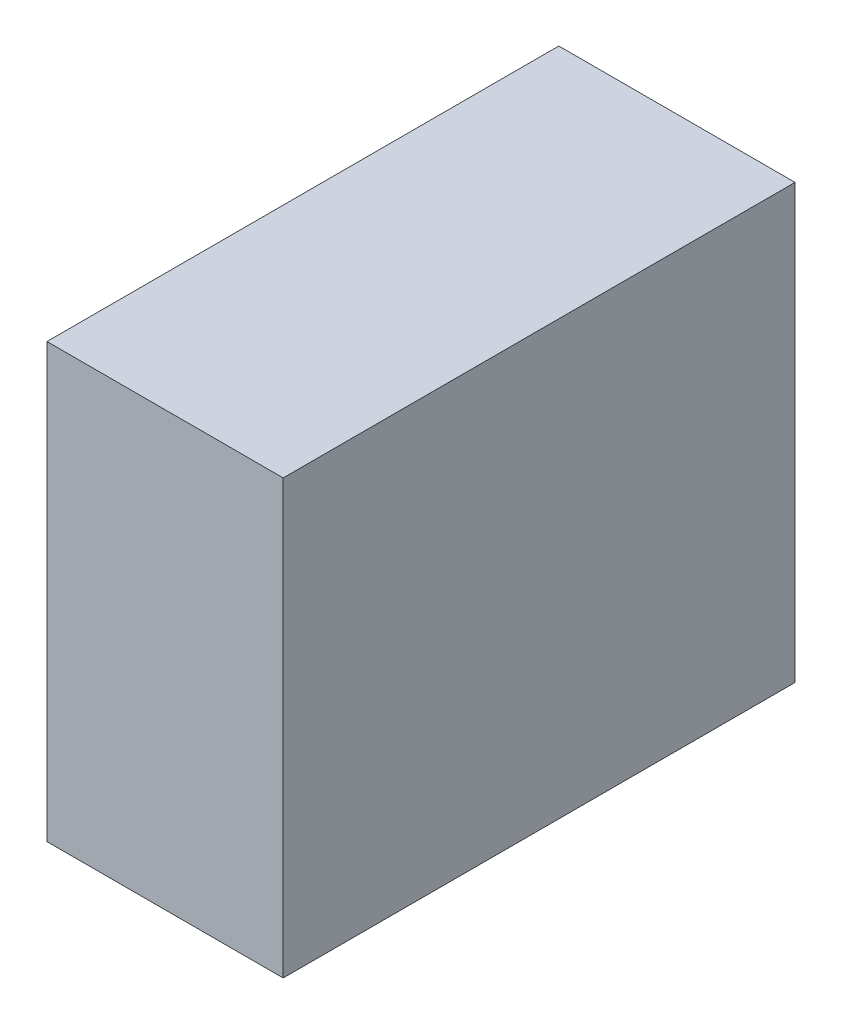
ISO-10303-21;
HEADER;
FILE_DESCRIPTION(('STEP AP214'),'2;1');
FILE_NAME('part.step','',(''),(''),'','','');
FILE_SCHEMA(('AUTOMOTIVE_DESIGN { 1 0 10303 214 1 1 1 1 }'));
ENDSEC;
DATA;
#1=APPLICATION_CONTEXT('core data for automotive mechanical design processes');
#2=APPLICATION_PROTOCOL_DEFINITION('international standard','automotive_design',2000,#1);
#3=PRODUCT_CONTEXT('',#1,'mechanical');
#4=PRODUCT('Part','Part','',(#3));
#5=PRODUCT_RELATED_PRODUCT_CATEGORY('part','',(#4));
#6=PRODUCT_DEFINITION_FORMATION('','',#4);
#7=PRODUCT_DEFINITION_CONTEXT('part definition',#1,'design');
#8=PRODUCT_DEFINITION('design','',#6,#7);
#9=PRODUCT_DEFINITION_SHAPE('','',#8);
#10=(LENGTH_UNIT() NAMED_UNIT(*) SI_UNIT(.MILLI.,.METRE.));
#11=(NAMED_UNIT(*) PLANE_ANGLE_UNIT() SI_UNIT($,.RADIAN.));
#12=(NAMED_UNIT(*) SI_UNIT($,.STERADIAN.) SOLID_ANGLE_UNIT());
#13=UNCERTAINTY_MEASURE_WITH_UNIT(LENGTH_MEASURE(1.E-05),#10,'distance_accuracy_value','');
#14=(GEOMETRIC_REPRESENTATION_CONTEXT(3) GLOBAL_UNCERTAINTY_ASSIGNED_CONTEXT((#13)) GLOBAL_UNIT_ASSIGNED_CONTEXT((#10,
#11,#12)) REPRESENTATION_CONTEXT('',''));
#15=CARTESIAN_POINT('',(0.,0.,0.));
#16=DIRECTION('',(0.,0.,1.));
#17=DIRECTION('',(1.,0.,0.));
#18=AXIS2_PLACEMENT_3D('',#15,#16,#17);
#19=CARTESIAN_POINT('',(-0.2999994,0.5499989,0.));
#20=DIRECTION('',(1.,0.,0.));
#21=DIRECTION('',(0.,0.,-1.));
#22=AXIS2_PLACEMENT_3D('',#19,#20,#21);
#23=PLANE('',#22);
#24=DIRECTION('',(0.,0.,1.));
#25=VECTOR('',#24,1.);
#26=CARTESIAN_POINT('',(-0.2999994,-0.5499989,0.));
#27=LINE('',#26,#25);
#28=CARTESIAN_POINT('',(-0.2999994,-0.5499989,0.));
#29=VERTEX_POINT('',#28);
#30=CARTESIAN_POINT('',(-0.2999994,-0.5499989,1.29999994));
#31=VERTEX_POINT('',#30);
#32=EDGE_CURVE('E20',#29,#31,#27,.T.);
#33=ORIENTED_EDGE('',*,*,#32,.T.);
#34=DIRECTION('',(0.,1.,0.));
#35=VECTOR('',#34,1.);
#36=CARTESIAN_POINT('',(-0.2999994,-0.5499989,1.29999994));
#37=LINE('',#36,#35);
#38=CARTESIAN_POINT('',(-0.2999994,0.5499989,1.29999994));
#39=VERTEX_POINT('',#38);
#40=EDGE_CURVE('E55',#31,#39,#37,.T.);
#41=ORIENTED_EDGE('',*,*,#40,.T.);
#42=DIRECTION('',(0.,0.,-1.));
#43=VECTOR('',#42,1.);
#44=CARTESIAN_POINT('',(-0.2999994,0.5499989,0.));
#45=LINE('',#44,#43);
#46=CARTESIAN_POINT('',(-0.2999994,0.5499989,0.));
#47=VERTEX_POINT('',#46);
#48=EDGE_CURVE('E76',#39,#47,#45,.T.);
#49=ORIENTED_EDGE('',*,*,#48,.T.);
#50=DIRECTION('',(0.,1.,0.));
#51=VECTOR('',#50,1.);
#52=CARTESIAN_POINT('',(-0.2999994,-0.5499989,0.));
#53=LINE('',#52,#51);
#54=EDGE_CURVE('E58',#29,#47,#53,.T.);
#55=ORIENTED_EDGE('',*,*,#54,.F.);
#56=EDGE_LOOP('',(#33,#41,#49,#55));
#57=FACE_BOUND('',#56,.T.);
#58=ADVANCED_FACE('F17',(#57),#23,.F.);
#59=CARTESIAN_POINT('',(-0.2999994,-0.5499989,0.));
#60=DIRECTION('',(0.,1.,0.));
#61=DIRECTION('',(0.,0.,1.));
#62=AXIS2_PLACEMENT_3D('',#59,#60,#61);
#63=PLANE('',#62);
#64=DIRECTION('',(0.,0.,1.));
#65=VECTOR('',#64,1.);
#66=CARTESIAN_POINT('',(0.2999994,-0.5499989,0.));
#67=LINE('',#66,#65);
#68=CARTESIAN_POINT('',(0.2999994,-0.5499989,0.));
#69=VERTEX_POINT('',#68);
#70=CARTESIAN_POINT('',(0.2999994,-0.5499989,1.29999994));
#71=VERTEX_POINT('',#70);
#72=EDGE_CURVE('E73',#69,#71,#67,.T.);
#73=ORIENTED_EDGE('',*,*,#72,.T.);
#74=DIRECTION('',(-1.,0.,0.));
#75=VECTOR('',#74,1.);
#76=CARTESIAN_POINT('',(0.2999994,-0.5499989,1.29999994));
#77=LINE('',#76,#75);
#78=EDGE_CURVE('E63',#71,#31,#77,.T.);
#79=ORIENTED_EDGE('',*,*,#78,.T.);
#80=ORIENTED_EDGE('',*,*,#32,.F.);
#81=DIRECTION('',(-1.,0.,0.));
#82=VECTOR('',#81,1.);
#83=CARTESIAN_POINT('',(0.2999994,-0.5499989,0.));
#84=LINE('',#83,#82);
#85=EDGE_CURVE('E78',#69,#29,#84,.T.);
#86=ORIENTED_EDGE('',*,*,#85,.F.);
#87=EDGE_LOOP('',(#73,#79,#80,#86));
#88=FACE_BOUND('',#87,.T.);
#89=ADVANCED_FACE('F72',(#88),#63,.F.);
#90=CARTESIAN_POINT('',(0.2999994,-0.5499989,1.29999994));
#91=DIRECTION('',(0.,0.,-1.));
#92=DIRECTION('',(-1.,0.,0.));
#93=AXIS2_PLACEMENT_3D('',#90,#91,#92);
#94=PLANE('',#93);
#95=DIRECTION('',(1.,0.,0.));
#96=VECTOR('',#95,1.);
#97=CARTESIAN_POINT('',(0.2999994,0.5499989,1.29999994));
#98=LINE('',#97,#96);
#99=CARTESIAN_POINT('',(0.2999994,0.5499989,1.29999994));
#100=VERTEX_POINT('',#99);
#101=EDGE_CURVE('E69',#100,#39,#98,.F.);
#102=ORIENTED_EDGE('',*,*,#101,.T.);
#103=ORIENTED_EDGE('',*,*,#40,.F.);
#104=ORIENTED_EDGE('',*,*,#78,.F.);
#105=DIRECTION('',(0.,1.,0.));
#106=VECTOR('',#105,1.);
#107=CARTESIAN_POINT('',(0.2999994,-0.5499989,1.29999994));
#108=LINE('',#107,#106);
#109=EDGE_CURVE('E83',#71,#100,#108,.T.);
#110=ORIENTED_EDGE('',*,*,#109,.T.);
#111=EDGE_LOOP('',(#102,#103,#104,#110));
#112=FACE_BOUND('',#111,.T.);
#113=ADVANCED_FACE('F66',(#112),#94,.F.);
#114=CARTESIAN_POINT('',(0.2999994,0.5499989,0.));
#115=DIRECTION('',(0.,-1.,0.));
#116=DIRECTION('',(0.,0.,-1.));
#117=AXIS2_PLACEMENT_3D('',#114,#115,#116);
#118=PLANE('',#117);
#119=ORIENTED_EDGE('',*,*,#48,.F.);
#120=ORIENTED_EDGE('',*,*,#101,.F.);
#121=DIRECTION('',(0.,0.,1.));
#122=VECTOR('',#121,1.);
#123=CARTESIAN_POINT('',(0.2999994,0.5499989,0.));
#124=LINE('',#123,#122);
#125=CARTESIAN_POINT('',(0.2999994,0.5499989,0.));
#126=VERTEX_POINT('',#125);
#127=EDGE_CURVE('E26',#100,#126,#124,.F.);
#128=ORIENTED_EDGE('',*,*,#127,.T.);
#129=DIRECTION('',(-1.,0.,0.));
#130=VECTOR('',#129,1.);
#131=CARTESIAN_POINT('',(0.2999994,0.5499989,0.));
#132=LINE('',#131,#130);
#133=EDGE_CURVE('E34',#47,#126,#132,.F.);
#134=ORIENTED_EDGE('',*,*,#133,.F.);
#135=EDGE_LOOP('',(#119,#120,#128,#134));
#136=FACE_BOUND('',#135,.T.);
#137=ADVANCED_FACE('F88',(#136),#118,.F.);
#138=CARTESIAN_POINT('',(0.2999994,-0.5499989,0.));
#139=DIRECTION('',(0.,0.,-1.));
#140=DIRECTION('',(-1.,0.,0.));
#141=AXIS2_PLACEMENT_3D('',#138,#139,#140);
#142=PLANE('',#141);
#143=ORIENTED_EDGE('',*,*,#133,.T.);
#144=DIRECTION('',(0.,1.,0.));
#145=VECTOR('',#144,1.);
#146=CARTESIAN_POINT('',(0.2999994,-0.5499989,0.));
#147=LINE('',#146,#145);
#148=EDGE_CURVE('E11',#126,#69,#147,.F.);
#149=ORIENTED_EDGE('',*,*,#148,.T.);
#150=ORIENTED_EDGE('',*,*,#85,.T.);
#151=ORIENTED_EDGE('',*,*,#54,.T.);
#152=EDGE_LOOP('',(#143,#149,#150,#151));
#153=FACE_BOUND('',#152,.T.);
#154=ADVANCED_FACE('F91',(#153),#142,.T.);
#155=CARTESIAN_POINT('',(0.2999994,-0.5499989,0.));
#156=DIRECTION('',(-1.,0.,0.));
#157=DIRECTION('',(0.,0.,1.));
#158=AXIS2_PLACEMENT_3D('',#155,#156,#157);
#159=PLANE('',#158);
#160=ORIENTED_EDGE('',*,*,#127,.F.);
#161=ORIENTED_EDGE('',*,*,#109,.F.);
#162=ORIENTED_EDGE('',*,*,#72,.F.);
#163=ORIENTED_EDGE('',*,*,#148,.F.);
#164=EDGE_LOOP('',(#160,#161,#162,#163));
#165=FACE_BOUND('',#164,.T.);
#166=ADVANCED_FACE('F90',(#165),#159,.F.);
#167=CLOSED_SHELL('',(#58,#89,#113,#137,#154,#166));
#168=MANIFOLD_SOLID_BREP('B1',#167);
#169=ADVANCED_BREP_SHAPE_REPRESENTATION('',(#18,#168),#14);
#170=SHAPE_DEFINITION_REPRESENTATION(#9,#169);
ENDSEC;
END-ISO-10303-21;
